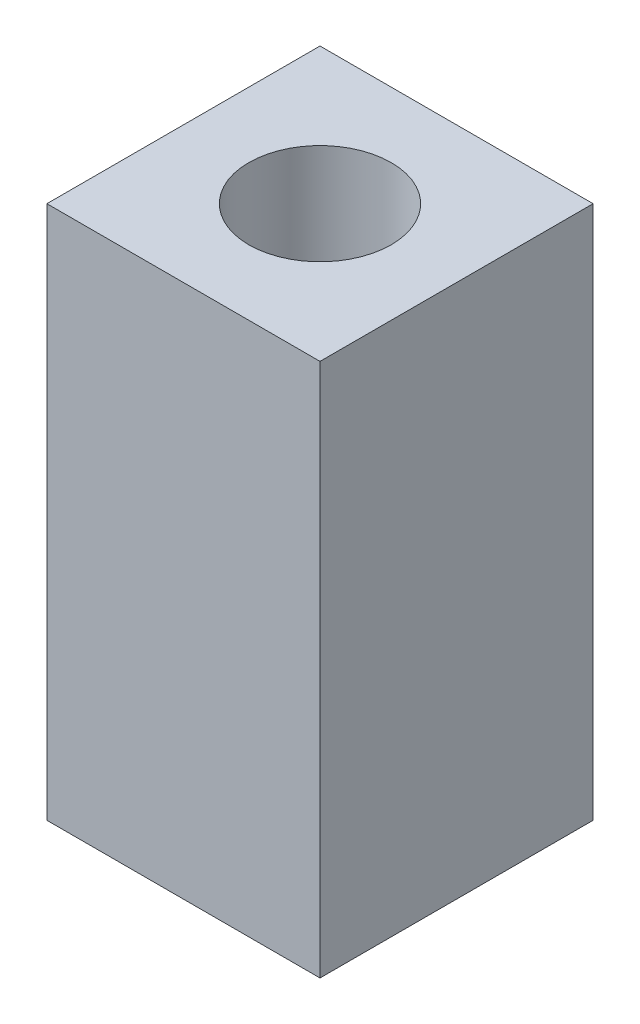
ISO-10303-21;
HEADER;
FILE_DESCRIPTION(('STEP AP214'),'2;1');
FILE_NAME('part.step','',(''),(''),'','','');
FILE_SCHEMA(('AUTOMOTIVE_DESIGN { 1 0 10303 214 1 1 1 1 }'));
ENDSEC;
DATA;
#1=APPLICATION_CONTEXT('core data for automotive mechanical design processes');
#2=APPLICATION_PROTOCOL_DEFINITION('international standard','automotive_design',2000,#1);
#3=PRODUCT_CONTEXT('',#1,'mechanical');
#4=PRODUCT('Part','Part','',(#3));
#5=PRODUCT_RELATED_PRODUCT_CATEGORY('part','',(#4));
#6=PRODUCT_DEFINITION_FORMATION('','',#4);
#7=PRODUCT_DEFINITION_CONTEXT('part definition',#1,'design');
#8=PRODUCT_DEFINITION('design','',#6,#7);
#9=PRODUCT_DEFINITION_SHAPE('','',#8);
#10=(LENGTH_UNIT() NAMED_UNIT(*) SI_UNIT(.MILLI.,.METRE.));
#11=(NAMED_UNIT(*) PLANE_ANGLE_UNIT() SI_UNIT($,.RADIAN.));
#12=(NAMED_UNIT(*) SI_UNIT($,.STERADIAN.) SOLID_ANGLE_UNIT());
#13=UNCERTAINTY_MEASURE_WITH_UNIT(LENGTH_MEASURE(1.E-05),#10,'distance_accuracy_value','');
#14=(GEOMETRIC_REPRESENTATION_CONTEXT(3) GLOBAL_UNCERTAINTY_ASSIGNED_CONTEXT((#13)) GLOBAL_UNIT_ASSIGNED_CONTEXT((#10,
#11,#12)) REPRESENTATION_CONTEXT('',''));
#15=CARTESIAN_POINT('',(0.,0.,0.));
#16=DIRECTION('',(0.,0.,1.));
#17=DIRECTION('',(1.,0.,0.));
#18=AXIS2_PLACEMENT_3D('',#15,#16,#17);
#19=CARTESIAN_POINT('',(0.,22.5,0.));
#20=DIRECTION('',(0.,-1.,0.));
#21=DIRECTION('',(0.,0.,-1.));
#22=AXIS2_PLACEMENT_3D('',#19,#20,#21);
#23=PLANE('',#22);
#24=DIRECTION('',(0.,0.,-1.));
#25=VECTOR('',#24,1.);
#26=CARTESIAN_POINT('',(5.75345389828202,22.5,5.75345389828202));
#27=LINE('',#26,#25);
#28=CARTESIAN_POINT('',(5.75345389828202,22.5,5.75345389828202));
#29=VERTEX_POINT('',#28);
#30=CARTESIAN_POINT('',(5.75345389828202,22.5,-5.75345389828202));
#31=VERTEX_POINT('',#30);
#32=EDGE_CURVE('E92',#29,#31,#27,.T.);
#33=ORIENTED_EDGE('',*,*,#32,.T.);
#34=DIRECTION('',(-1.,0.,0.));
#35=VECTOR('',#34,1.);
#36=CARTESIAN_POINT('',(-5.75345389828202,22.5,-5.75345389828202));
#37=LINE('',#36,#35);
#38=CARTESIAN_POINT('',(-5.75345389828202,22.5,-5.75345389828202));
#39=VERTEX_POINT('',#38);
#40=EDGE_CURVE('E87',#31,#39,#37,.T.);
#41=ORIENTED_EDGE('',*,*,#40,.T.);
#42=DIRECTION('',(0.,0.,1.));
#43=VECTOR('',#42,1.);
#44=CARTESIAN_POINT('',(-5.75345389828202,22.5,5.75345389828202));
#45=LINE('',#44,#43);
#46=CARTESIAN_POINT('',(-5.75345389828202,22.5,5.75345389828202));
#47=VERTEX_POINT('',#46);
#48=EDGE_CURVE('E90',#39,#47,#45,.T.);
#49=ORIENTED_EDGE('',*,*,#48,.T.);
#50=DIRECTION('',(1.,0.,0.));
#51=VECTOR('',#50,1.);
#52=CARTESIAN_POINT('',(-5.75345389828202,22.5,5.75345389828202));
#53=LINE('',#52,#51);
#54=EDGE_CURVE('E57',#47,#29,#53,.T.);
#55=ORIENTED_EDGE('',*,*,#54,.T.);
#56=EDGE_LOOP('',(#33,#41,#49,#55));
#57=FACE_BOUND('',#56,.T.);
#58=CARTESIAN_POINT('',(0.,22.5,0.));
#59=DIRECTION('',(0.,1.,0.));
#60=DIRECTION('',(0.,0.,1.));
#61=AXIS2_PLACEMENT_3D('',#58,#59,#60);
#62=CIRCLE('',#61,3.);
#63=CARTESIAN_POINT('',(0.,22.5,3.));
#64=VERTEX_POINT('',#63);
#65=EDGE_CURVE('E112',#64,#64,#62,.T.);
#66=ORIENTED_EDGE('',*,*,#65,.F.);
#67=EDGE_LOOP('',(#66));
#68=FACE_BOUND('',#67,.T.);
#69=ADVANCED_FACE('F39',(#57,#68),#23,.F.);
#70=CARTESIAN_POINT('',(0.,0.,0.));
#71=DIRECTION('',(0.,-1.,0.));
#72=DIRECTION('',(0.,0.,-1.));
#73=AXIS2_PLACEMENT_3D('',#70,#71,#72);
#74=PLANE('',#73);
#75=DIRECTION('',(0.,0.,-1.));
#76=VECTOR('',#75,1.);
#77=CARTESIAN_POINT('',(5.75345389828202,0.,5.75345389828202));
#78=LINE('',#77,#76);
#79=CARTESIAN_POINT('',(5.75345389828202,0.,5.75345389828202));
#80=VERTEX_POINT('',#79);
#81=CARTESIAN_POINT('',(5.75345389828202,0.,-5.75345389828202));
#82=VERTEX_POINT('',#81);
#83=EDGE_CURVE('E108',#80,#82,#78,.T.);
#84=ORIENTED_EDGE('',*,*,#83,.F.);
#85=DIRECTION('',(1.,0.,0.));
#86=VECTOR('',#85,1.);
#87=CARTESIAN_POINT('',(-5.75345389828202,0.,5.75345389828202));
#88=LINE('',#87,#86);
#89=CARTESIAN_POINT('',(-5.75345389828202,0.,5.75345389828202));
#90=VERTEX_POINT('',#89);
#91=EDGE_CURVE('E80',#90,#80,#88,.T.);
#92=ORIENTED_EDGE('',*,*,#91,.F.);
#93=DIRECTION('',(0.,0.,1.));
#94=VECTOR('',#93,1.);
#95=CARTESIAN_POINT('',(-5.75345389828202,0.,5.75345389828202));
#96=LINE('',#95,#94);
#97=CARTESIAN_POINT('',(-5.75345389828202,0.,-5.75345389828202));
#98=VERTEX_POINT('',#97);
#99=EDGE_CURVE('E74',#98,#90,#96,.T.);
#100=ORIENTED_EDGE('',*,*,#99,.F.);
#101=DIRECTION('',(-1.,0.,0.));
#102=VECTOR('',#101,1.);
#103=CARTESIAN_POINT('',(-5.75345389828202,0.,-5.75345389828202));
#104=LINE('',#103,#102);
#105=EDGE_CURVE('E97',#82,#98,#104,.T.);
#106=ORIENTED_EDGE('',*,*,#105,.F.);
#107=EDGE_LOOP('',(#84,#92,#100,#106));
#108=FACE_BOUND('',#107,.T.);
#109=CARTESIAN_POINT('',(0.,0.,0.));
#110=DIRECTION('',(0.,1.,0.));
#111=DIRECTION('',(0.,0.,1.));
#112=AXIS2_PLACEMENT_3D('',#109,#110,#111);
#113=CIRCLE('',#112,3.);
#114=CARTESIAN_POINT('',(0.,0.,3.));
#115=VERTEX_POINT('',#114);
#116=EDGE_CURVE('E130',#115,#115,#113,.T.);
#117=ORIENTED_EDGE('',*,*,#116,.T.);
#118=EDGE_LOOP('',(#117));
#119=FACE_BOUND('',#118,.T.);
#120=ADVANCED_FACE('F125',(#108,#119),#74,.T.);
#121=CARTESIAN_POINT('',(5.75345389828202,22.5,5.75345389828202));
#122=DIRECTION('',(-1.,0.,0.));
#123=DIRECTION('',(0.,0.,1.));
#124=AXIS2_PLACEMENT_3D('',#121,#122,#123);
#125=PLANE('',#124);
#126=ORIENTED_EDGE('',*,*,#83,.T.);
#127=DIRECTION('',(0.,-1.,0.));
#128=VECTOR('',#127,1.);
#129=CARTESIAN_POINT('',(5.75345389828202,22.5,-5.75345389828202));
#130=LINE('',#129,#128);
#131=EDGE_CURVE('E11',#31,#82,#130,.T.);
#132=ORIENTED_EDGE('',*,*,#131,.F.);
#133=ORIENTED_EDGE('',*,*,#32,.F.);
#134=DIRECTION('',(0.,-1.,0.));
#135=VECTOR('',#134,1.);
#136=CARTESIAN_POINT('',(5.75345389828202,22.5,5.75345389828202));
#137=LINE('',#136,#135);
#138=EDGE_CURVE('E104',#29,#80,#137,.T.);
#139=ORIENTED_EDGE('',*,*,#138,.T.);
#140=EDGE_LOOP('',(#126,#132,#133,#139));
#141=FACE_BOUND('',#140,.T.);
#142=ADVANCED_FACE('F41',(#141),#125,.F.);
#143=CARTESIAN_POINT('',(-5.75345389828202,22.5,-5.75345389828202));
#144=DIRECTION('',(0.,0.,1.));
#145=DIRECTION('',(1.,0.,0.));
#146=AXIS2_PLACEMENT_3D('',#143,#144,#145);
#147=PLANE('',#146);
#148=ORIENTED_EDGE('',*,*,#105,.T.);
#149=DIRECTION('',(0.,-1.,0.));
#150=VECTOR('',#149,1.);
#151=CARTESIAN_POINT('',(-5.75345389828202,22.5,-5.75345389828202));
#152=LINE('',#151,#150);
#153=EDGE_CURVE('E49',#39,#98,#152,.T.);
#154=ORIENTED_EDGE('',*,*,#153,.F.);
#155=ORIENTED_EDGE('',*,*,#40,.F.);
#156=ORIENTED_EDGE('',*,*,#131,.T.);
#157=EDGE_LOOP('',(#148,#154,#155,#156));
#158=FACE_BOUND('',#157,.T.);
#159=ADVANCED_FACE('F96',(#158),#147,.F.);
#160=CARTESIAN_POINT('',(-5.75345389828202,22.5,5.75345389828202));
#161=DIRECTION('',(1.,0.,0.));
#162=DIRECTION('',(0.,0.,-1.));
#163=AXIS2_PLACEMENT_3D('',#160,#161,#162);
#164=PLANE('',#163);
#165=ORIENTED_EDGE('',*,*,#99,.T.);
#166=DIRECTION('',(0.,-1.,0.));
#167=VECTOR('',#166,1.);
#168=CARTESIAN_POINT('',(-5.75345389828202,22.5,5.75345389828202));
#169=LINE('',#168,#167);
#170=EDGE_CURVE('E99',#47,#90,#169,.T.);
#171=ORIENTED_EDGE('',*,*,#170,.F.);
#172=ORIENTED_EDGE('',*,*,#48,.F.);
#173=ORIENTED_EDGE('',*,*,#153,.T.);
#174=EDGE_LOOP('',(#165,#171,#172,#173));
#175=FACE_BOUND('',#174,.T.);
#176=ADVANCED_FACE('F100',(#175),#164,.F.);
#177=CARTESIAN_POINT('',(-5.75345389828202,22.5,5.75345389828202));
#178=DIRECTION('',(0.,0.,-1.));
#179=DIRECTION('',(-1.,0.,0.));
#180=AXIS2_PLACEMENT_3D('',#177,#178,#179);
#181=PLANE('',#180);
#182=ORIENTED_EDGE('',*,*,#91,.T.);
#183=ORIENTED_EDGE('',*,*,#138,.F.);
#184=ORIENTED_EDGE('',*,*,#54,.F.);
#185=ORIENTED_EDGE('',*,*,#170,.T.);
#186=EDGE_LOOP('',(#182,#183,#184,#185));
#187=FACE_BOUND('',#186,.T.);
#188=ADVANCED_FACE('F122',(#187),#181,.F.);
#189=CARTESIAN_POINT('',(0.,22.5,0.));
#190=DIRECTION('',(0.,-1.,0.));
#191=DIRECTION('',(0.,0.,-1.));
#192=AXIS2_PLACEMENT_3D('',#189,#190,#191);
#193=CYLINDRICAL_SURFACE('',#192,3.);
#194=ORIENTED_EDGE('',*,*,#65,.T.);
#195=EDGE_LOOP('',(#194));
#196=FACE_BOUND('',#195,.T.);
#197=ORIENTED_EDGE('',*,*,#116,.F.);
#198=EDGE_LOOP('',(#197));
#199=FACE_BOUND('',#198,.T.);
#200=ADVANCED_FACE('F138',(#196,#199),#193,.F.);
#201=CLOSED_SHELL('',(#69,#120,#142,#159,#176,#188,#200));
#202=MANIFOLD_SOLID_BREP('B2',#201);
#203=ADVANCED_BREP_SHAPE_REPRESENTATION('',(#18,#202),#14);
#204=SHAPE_DEFINITION_REPRESENTATION(#9,#203);
ENDSEC;
END-ISO-10303-21;
